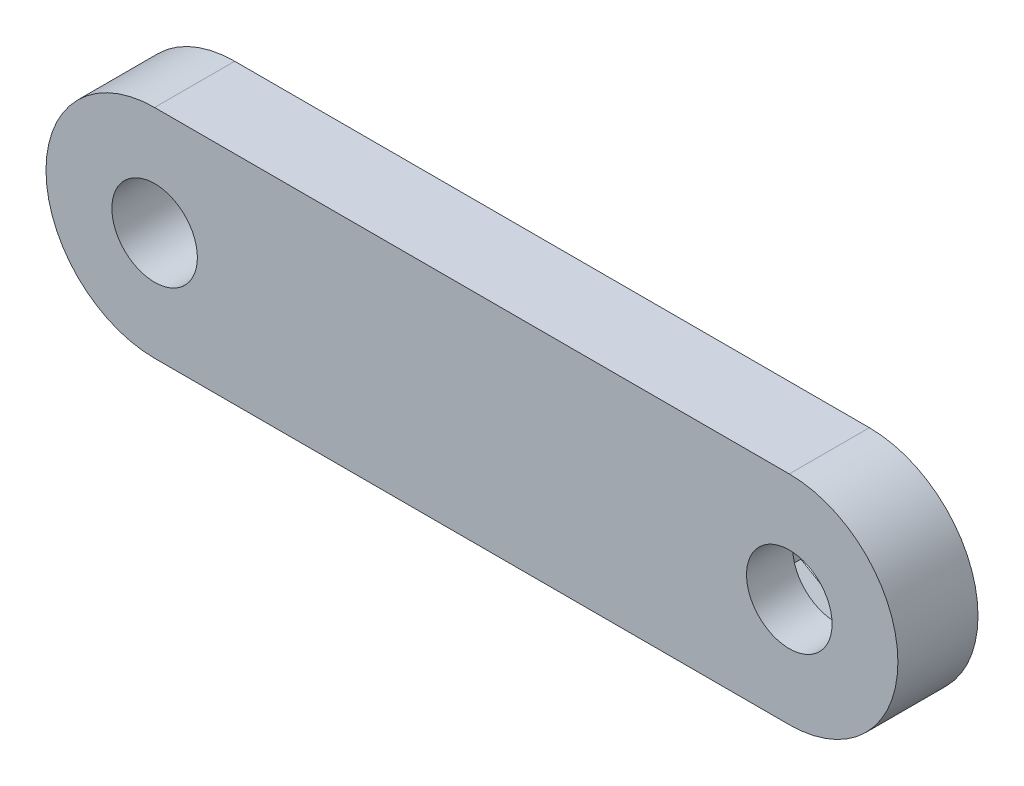
ISO-10303-21;
HEADER;
FILE_DESCRIPTION(('STEP AP214'),'2;1');
FILE_NAME('part.step','',(''),(''),'','','');
FILE_SCHEMA(('AUTOMOTIVE_DESIGN { 1 0 10303 214 1 1 1 1 }'));
ENDSEC;
DATA;
#1=APPLICATION_CONTEXT('core data for automotive mechanical design processes');
#2=APPLICATION_PROTOCOL_DEFINITION('international standard','automotive_design',2000,#1);
#3=PRODUCT_CONTEXT('',#1,'mechanical');
#4=PRODUCT('Part','Part','',(#3));
#5=PRODUCT_RELATED_PRODUCT_CATEGORY('part','',(#4));
#6=PRODUCT_DEFINITION_FORMATION('','',#4);
#7=PRODUCT_DEFINITION_CONTEXT('part definition',#1,'design');
#8=PRODUCT_DEFINITION('design','',#6,#7);
#9=PRODUCT_DEFINITION_SHAPE('','',#8);
#10=(LENGTH_UNIT() NAMED_UNIT(*) SI_UNIT(.MILLI.,.METRE.));
#11=(NAMED_UNIT(*) PLANE_ANGLE_UNIT() SI_UNIT($,.RADIAN.));
#12=(NAMED_UNIT(*) SI_UNIT($,.STERADIAN.) SOLID_ANGLE_UNIT());
#13=UNCERTAINTY_MEASURE_WITH_UNIT(LENGTH_MEASURE(1.E-05),#10,'distance_accuracy_value','');
#14=(GEOMETRIC_REPRESENTATION_CONTEXT(3) GLOBAL_UNCERTAINTY_ASSIGNED_CONTEXT((#13)) GLOBAL_UNIT_ASSIGNED_CONTEXT((#10,
#11,#12)) REPRESENTATION_CONTEXT('',''));
#15=CARTESIAN_POINT('',(0.,0.,0.));
#16=DIRECTION('',(0.,0.,1.));
#17=DIRECTION('',(1.,0.,0.));
#18=AXIS2_PLACEMENT_3D('',#15,#16,#17);
#19=CARTESIAN_POINT('',(23.375,0.,0.));
#20=DIRECTION('',(0.,0.,1.));
#21=DIRECTION('',(1.,0.,0.));
#22=AXIS2_PLACEMENT_3D('',#19,#20,#21);
#23=PLANE('',#22);
#24=CARTESIAN_POINT('',(-23.375,0.,0.));
#25=DIRECTION('',(0.,0.,1.));
#26=DIRECTION('',(1.,0.,0.));
#27=AXIS2_PLACEMENT_3D('',#24,#25,#26);
#28=CIRCLE('',#27,3.15);
#29=CARTESIAN_POINT('',(-20.225,0.,0.));
#30=VERTEX_POINT('',#29);
#31=EDGE_CURVE('E155',#30,#30,#28,.T.);
#32=ORIENTED_EDGE('',*,*,#31,.T.);
#33=EDGE_LOOP('',(#32));
#34=FACE_BOUND('',#33,.T.);
#35=CARTESIAN_POINT('',(23.375,0.,0.));
#36=DIRECTION('',(0.,0.,1.));
#37=DIRECTION('',(1.,0.,0.));
#38=AXIS2_PLACEMENT_3D('',#35,#36,#37);
#39=CIRCLE('',#38,8.);
#40=CARTESIAN_POINT('',(23.375,-7.99999999999999,0.));
#41=VERTEX_POINT('',#40);
#42=CARTESIAN_POINT('',(23.375,8.00000000000001,0.));
#43=VERTEX_POINT('',#42);
#44=EDGE_CURVE('E170',#41,#43,#39,.T.);
#45=ORIENTED_EDGE('',*,*,#44,.F.);
#46=DIRECTION('',(1.,0.,0.));
#47=VECTOR('',#46,1.);
#48=CARTESIAN_POINT('',(23.375,-7.99999999999999,0.));
#49=LINE('',#48,#47);
#50=CARTESIAN_POINT('',(-23.375,-8.,0.));
#51=VERTEX_POINT('',#50);
#52=EDGE_CURVE('E89',#51,#41,#49,.T.);
#53=ORIENTED_EDGE('',*,*,#52,.F.);
#54=CARTESIAN_POINT('',(-23.375,0.,0.));
#55=DIRECTION('',(0.,0.,1.));
#56=DIRECTION('',(1.,0.,0.));
#57=AXIS2_PLACEMENT_3D('',#54,#55,#56);
#58=CIRCLE('',#57,8.);
#59=CARTESIAN_POINT('',(-23.375,7.99999999999999,0.));
#60=VERTEX_POINT('',#59);
#61=EDGE_CURVE('E186',#60,#51,#58,.T.);
#62=ORIENTED_EDGE('',*,*,#61,.F.);
#63=DIRECTION('',(-1.,0.,0.));
#64=VECTOR('',#63,1.);
#65=CARTESIAN_POINT('',(23.375,8.00000000000001,0.));
#66=LINE('',#65,#64);
#67=EDGE_CURVE('E183',#43,#60,#66,.T.);
#68=ORIENTED_EDGE('',*,*,#67,.F.);
#69=EDGE_LOOP('',(#45,#53,#62,#68));
#70=FACE_BOUND('',#69,.T.);
#71=DIRECTION('',(-0.866025403784439,0.5,0.));
#72=VECTOR('',#71,1.);
#73=CARTESIAN_POINT('',(28.425,2.91561885940763,0.));
#74=LINE('',#73,#72);
#75=CARTESIAN_POINT('',(28.425,2.91561885940763,0.));
#76=VERTEX_POINT('',#75);
#77=CARTESIAN_POINT('',(23.375,5.83123771881524,0.));
#78=VERTEX_POINT('',#77);
#79=EDGE_CURVE('E56',#76,#78,#74,.T.);
#80=ORIENTED_EDGE('',*,*,#79,.T.);
#81=DIRECTION('',(-0.866025403784439,-0.5,0.));
#82=VECTOR('',#81,1.);
#83=CARTESIAN_POINT('',(23.375,5.83123771881524,0.));
#84=LINE('',#83,#82);
#85=CARTESIAN_POINT('',(18.325,2.91561885940763,0.));
#86=VERTEX_POINT('',#85);
#87=EDGE_CURVE('E151',#78,#86,#84,.T.);
#88=ORIENTED_EDGE('',*,*,#87,.T.);
#89=DIRECTION('',(0.,-1.,0.));
#90=VECTOR('',#89,1.);
#91=CARTESIAN_POINT('',(18.325,2.91561885940763,0.));
#92=LINE('',#91,#90);
#93=CARTESIAN_POINT('',(18.325,-2.9156188594076,0.));
#94=VERTEX_POINT('',#93);
#95=EDGE_CURVE('E367',#86,#94,#92,.T.);
#96=ORIENTED_EDGE('',*,*,#95,.T.);
#97=DIRECTION('',(0.866025403784439,-0.5,0.));
#98=VECTOR('',#97,1.);
#99=CARTESIAN_POINT('',(18.325,-2.9156188594076,0.));
#100=LINE('',#99,#98);
#101=CARTESIAN_POINT('',(23.375,-5.83123771881521,0.));
#102=VERTEX_POINT('',#101);
#103=EDGE_CURVE('E364',#94,#102,#100,.T.);
#104=ORIENTED_EDGE('',*,*,#103,.T.);
#105=DIRECTION('',(0.866025403784439,0.5,0.));
#106=VECTOR('',#105,1.);
#107=CARTESIAN_POINT('',(23.375,-5.83123771881521,0.));
#108=LINE('',#107,#106);
#109=CARTESIAN_POINT('',(28.425,-2.91561885940761,0.));
#110=VERTEX_POINT('',#109);
#111=EDGE_CURVE('E358',#102,#110,#108,.T.);
#112=ORIENTED_EDGE('',*,*,#111,.T.);
#113=DIRECTION('',(0.,1.,0.));
#114=VECTOR('',#113,1.);
#115=CARTESIAN_POINT('',(28.425,-2.91561885940761,0.));
#116=LINE('',#115,#114);
#117=EDGE_CURVE('E147',#110,#76,#116,.T.);
#118=ORIENTED_EDGE('',*,*,#117,.T.);
#119=EDGE_LOOP('',(#80,#88,#96,#104,#112,#118));
#120=FACE_BOUND('',#119,.T.);
#121=ADVANCED_FACE('F40',(#34,#70,#120),#23,.F.);
#122=CARTESIAN_POINT('',(23.375,0.,5.9));
#123=DIRECTION('',(0.,0.,1.));
#124=DIRECTION('',(1.,0.,0.));
#125=AXIS2_PLACEMENT_3D('',#122,#123,#124);
#126=PLANE('',#125);
#127=CARTESIAN_POINT('',(23.375,0.,5.9));
#128=DIRECTION('',(0.,0.,1.));
#129=DIRECTION('',(1.,0.,0.));
#130=AXIS2_PLACEMENT_3D('',#127,#128,#129);
#131=CIRCLE('',#130,3.15);
#132=CARTESIAN_POINT('',(26.525,0.,5.9));
#133=VERTEX_POINT('',#132);
#134=EDGE_CURVE('E164',#133,#133,#131,.T.);
#135=ORIENTED_EDGE('',*,*,#134,.F.);
#136=EDGE_LOOP('',(#135));
#137=FACE_BOUND('',#136,.T.);
#138=CARTESIAN_POINT('',(23.375,0.,5.9));
#139=DIRECTION('',(0.,0.,1.));
#140=DIRECTION('',(1.,0.,0.));
#141=AXIS2_PLACEMENT_3D('',#138,#139,#140);
#142=CIRCLE('',#141,8.);
#143=CARTESIAN_POINT('',(23.375,-7.99999999999999,5.9));
#144=VERTEX_POINT('',#143);
#145=CARTESIAN_POINT('',(23.375,8.00000000000001,5.9));
#146=VERTEX_POINT('',#145);
#147=EDGE_CURVE('E171',#144,#146,#142,.T.);
#148=ORIENTED_EDGE('',*,*,#147,.T.);
#149=DIRECTION('',(-1.,0.,0.));
#150=VECTOR('',#149,1.);
#151=CARTESIAN_POINT('',(23.375,8.00000000000001,5.9));
#152=LINE('',#151,#150);
#153=CARTESIAN_POINT('',(-23.375,7.99999999999999,5.9));
#154=VERTEX_POINT('',#153);
#155=EDGE_CURVE('E96',#146,#154,#152,.T.);
#156=ORIENTED_EDGE('',*,*,#155,.T.);
#157=CARTESIAN_POINT('',(-23.375,0.,5.9));
#158=DIRECTION('',(0.,0.,1.));
#159=DIRECTION('',(1.,0.,0.));
#160=AXIS2_PLACEMENT_3D('',#157,#158,#159);
#161=CIRCLE('',#160,8.);
#162=CARTESIAN_POINT('',(-23.375,-8.,5.9));
#163=VERTEX_POINT('',#162);
#164=EDGE_CURVE('E175',#154,#163,#161,.T.);
#165=ORIENTED_EDGE('',*,*,#164,.T.);
#166=DIRECTION('',(1.,0.,0.));
#167=VECTOR('',#166,1.);
#168=CARTESIAN_POINT('',(23.375,-7.99999999999999,5.9));
#169=LINE('',#168,#167);
#170=EDGE_CURVE('E65',#163,#144,#169,.T.);
#171=ORIENTED_EDGE('',*,*,#170,.T.);
#172=EDGE_LOOP('',(#148,#156,#165,#171));
#173=FACE_BOUND('',#172,.T.);
#174=CARTESIAN_POINT('',(-23.375,0.,5.9));
#175=DIRECTION('',(0.,0.,1.));
#176=DIRECTION('',(1.,0.,0.));
#177=AXIS2_PLACEMENT_3D('',#174,#175,#176);
#178=CIRCLE('',#177,3.15);
#179=CARTESIAN_POINT('',(-20.225,0.,5.9));
#180=VERTEX_POINT('',#179);
#181=EDGE_CURVE('E160',#180,#180,#178,.T.);
#182=ORIENTED_EDGE('',*,*,#181,.F.);
#183=EDGE_LOOP('',(#182));
#184=FACE_BOUND('',#183,.T.);
#185=ADVANCED_FACE('F222',(#137,#173,#184),#126,.T.);
#186=CARTESIAN_POINT('',(23.375,0.,5.9));
#187=DIRECTION('',(0.,0.,-1.));
#188=DIRECTION('',(-1.,0.,0.));
#189=AXIS2_PLACEMENT_3D('',#186,#187,#188);
#190=CYLINDRICAL_SURFACE('',#189,8.);
#191=ORIENTED_EDGE('',*,*,#44,.T.);
#192=DIRECTION('',(0.,0.,-1.));
#193=VECTOR('',#192,1.);
#194=CARTESIAN_POINT('',(23.375,8.00000000000001,5.9));
#195=LINE('',#194,#193);
#196=EDGE_CURVE('E11',#146,#43,#195,.T.);
#197=ORIENTED_EDGE('',*,*,#196,.F.);
#198=ORIENTED_EDGE('',*,*,#147,.F.);
#199=DIRECTION('',(0.,0.,-1.));
#200=VECTOR('',#199,1.);
#201=CARTESIAN_POINT('',(23.375,-7.99999999999999,5.9));
#202=LINE('',#201,#200);
#203=EDGE_CURVE('E180',#144,#41,#202,.T.);
#204=ORIENTED_EDGE('',*,*,#203,.T.);
#205=EDGE_LOOP('',(#191,#197,#198,#204));
#206=FACE_BOUND('',#205,.T.);
#207=ADVANCED_FACE('F42',(#206),#190,.T.);
#208=CARTESIAN_POINT('',(23.375,8.00000000000001,5.9));
#209=DIRECTION('',(0.,-1.,0.));
#210=DIRECTION('',(1.,0.,0.));
#211=AXIS2_PLACEMENT_3D('',#208,#209,#210);
#212=PLANE('',#211);
#213=ORIENTED_EDGE('',*,*,#67,.T.);
#214=DIRECTION('',(0.,0.,-1.));
#215=VECTOR('',#214,1.);
#216=CARTESIAN_POINT('',(-23.375,7.99999999999999,5.9));
#217=LINE('',#216,#215);
#218=EDGE_CURVE('E49',#154,#60,#217,.T.);
#219=ORIENTED_EDGE('',*,*,#218,.F.);
#220=ORIENTED_EDGE('',*,*,#155,.F.);
#221=ORIENTED_EDGE('',*,*,#196,.T.);
#222=EDGE_LOOP('',(#213,#219,#220,#221));
#223=FACE_BOUND('',#222,.T.);
#224=ADVANCED_FACE('F219',(#223),#212,.F.);
#225=CARTESIAN_POINT('',(-23.375,0.,5.9));
#226=DIRECTION('',(0.,0.,-1.));
#227=DIRECTION('',(-1.,0.,0.));
#228=AXIS2_PLACEMENT_3D('',#225,#226,#227);
#229=CYLINDRICAL_SURFACE('',#228,8.);
#230=ORIENTED_EDGE('',*,*,#61,.T.);
#231=DIRECTION('',(0.,0.,-1.));
#232=VECTOR('',#231,1.);
#233=CARTESIAN_POINT('',(-23.375,-8.,5.9));
#234=LINE('',#233,#232);
#235=EDGE_CURVE('E192',#163,#51,#234,.T.);
#236=ORIENTED_EDGE('',*,*,#235,.F.);
#237=ORIENTED_EDGE('',*,*,#164,.F.);
#238=ORIENTED_EDGE('',*,*,#218,.T.);
#239=EDGE_LOOP('',(#230,#236,#237,#238));
#240=FACE_BOUND('',#239,.T.);
#241=ADVANCED_FACE('F200',(#240),#229,.T.);
#242=CARTESIAN_POINT('',(23.375,-7.99999999999999,5.9));
#243=DIRECTION('',(0.,1.,0.));
#244=DIRECTION('',(-1.,0.,0.));
#245=AXIS2_PLACEMENT_3D('',#242,#243,#244);
#246=PLANE('',#245);
#247=ORIENTED_EDGE('',*,*,#52,.T.);
#248=ORIENTED_EDGE('',*,*,#203,.F.);
#249=ORIENTED_EDGE('',*,*,#170,.F.);
#250=ORIENTED_EDGE('',*,*,#235,.T.);
#251=EDGE_LOOP('',(#247,#248,#249,#250));
#252=FACE_BOUND('',#251,.T.);
#253=ADVANCED_FACE('F208',(#252),#246,.F.);
#254=CARTESIAN_POINT('',(23.375,0.,5.9));
#255=DIRECTION('',(0.,0.,-1.));
#256=DIRECTION('',(-1.,0.,0.));
#257=AXIS2_PLACEMENT_3D('',#254,#255,#256);
#258=CYLINDRICAL_SURFACE('',#257,3.15);
#259=CARTESIAN_POINT('',(23.375,0.,2.5));
#260=DIRECTION('',(0.,0.,1.));
#261=DIRECTION('',(1.,0.,0.));
#262=AXIS2_PLACEMENT_3D('',#259,#260,#261);
#263=CIRCLE('',#262,3.15);
#264=CARTESIAN_POINT('',(26.525,0.,2.5));
#265=VERTEX_POINT('',#264);
#266=EDGE_CURVE('E44',#265,#265,#263,.T.);
#267=ORIENTED_EDGE('',*,*,#266,.F.);
#268=EDGE_LOOP('',(#267));
#269=FACE_BOUND('',#268,.T.);
#270=ORIENTED_EDGE('',*,*,#134,.T.);
#271=EDGE_LOOP('',(#270));
#272=FACE_BOUND('',#271,.T.);
#273=ADVANCED_FACE('F210',(#269,#272),#258,.F.);
#274=CARTESIAN_POINT('',(-23.375,0.,5.9));
#275=DIRECTION('',(0.,0.,-1.));
#276=DIRECTION('',(-1.,0.,0.));
#277=AXIS2_PLACEMENT_3D('',#274,#275,#276);
#278=CYLINDRICAL_SURFACE('',#277,3.15);
#279=ORIENTED_EDGE('',*,*,#181,.T.);
#280=EDGE_LOOP('',(#279));
#281=FACE_BOUND('',#280,.T.);
#282=ORIENTED_EDGE('',*,*,#31,.F.);
#283=EDGE_LOOP('',(#282));
#284=FACE_BOUND('',#283,.T.);
#285=ADVANCED_FACE('F215',(#281,#284),#278,.F.);
#286=CARTESIAN_POINT('',(28.425,2.91561885940763,2.5));
#287=DIRECTION('',(-0.5,-0.866025403784439,0.));
#288=DIRECTION('',(0.866025403784439,-0.5,0.));
#289=AXIS2_PLACEMENT_3D('',#286,#287,#288);
#290=PLANE('',#289);
#291=ORIENTED_EDGE('',*,*,#79,.F.);
#292=DIRECTION('',(0.,0.,-1.));
#293=VECTOR('',#292,1.);
#294=CARTESIAN_POINT('',(28.425,2.91561885940763,2.5));
#295=LINE('',#294,#293);
#296=CARTESIAN_POINT('',(28.425,2.91561885940763,2.5));
#297=VERTEX_POINT('',#296);
#298=EDGE_CURVE('E146',#297,#76,#295,.T.);
#299=ORIENTED_EDGE('',*,*,#298,.F.);
#300=DIRECTION('',(-0.866025403784439,0.5,0.));
#301=VECTOR('',#300,1.);
#302=CARTESIAN_POINT('',(28.425,2.91561885940763,2.5));
#303=LINE('',#302,#301);
#304=CARTESIAN_POINT('',(23.375,5.83123771881524,2.5));
#305=VERTEX_POINT('',#304);
#306=EDGE_CURVE('E137',#297,#305,#303,.T.);
#307=ORIENTED_EDGE('',*,*,#306,.T.);
#308=DIRECTION('',(0.,0.,-1.));
#309=VECTOR('',#308,1.);
#310=CARTESIAN_POINT('',(23.375,5.83123771881524,2.5));
#311=LINE('',#310,#309);
#312=EDGE_CURVE('E145',#305,#78,#311,.T.);
#313=ORIENTED_EDGE('',*,*,#312,.T.);
#314=EDGE_LOOP('',(#291,#299,#307,#313));
#315=FACE_BOUND('',#314,.T.);
#316=ADVANCED_FACE('F144',(#315),#290,.T.);
#317=CARTESIAN_POINT('',(23.375,5.83123771881524,2.5));
#318=DIRECTION('',(0.5,-0.866025403784439,0.));
#319=DIRECTION('',(0.866025403784439,0.5,0.));
#320=AXIS2_PLACEMENT_3D('',#317,#318,#319);
#321=PLANE('',#320);
#322=ORIENTED_EDGE('',*,*,#87,.F.);
#323=ORIENTED_EDGE('',*,*,#312,.F.);
#324=DIRECTION('',(-0.866025403784439,-0.5,0.));
#325=VECTOR('',#324,1.);
#326=CARTESIAN_POINT('',(23.375,5.83123771881524,2.5));
#327=LINE('',#326,#325);
#328=CARTESIAN_POINT('',(18.325,2.91561885940763,2.5));
#329=VERTEX_POINT('',#328);
#330=EDGE_CURVE('E133',#305,#329,#327,.T.);
#331=ORIENTED_EDGE('',*,*,#330,.T.);
#332=DIRECTION('',(0.,0.,-1.));
#333=VECTOR('',#332,1.);
#334=CARTESIAN_POINT('',(18.325,2.91561885940763,2.5));
#335=LINE('',#334,#333);
#336=EDGE_CURVE('E152',#329,#86,#335,.T.);
#337=ORIENTED_EDGE('',*,*,#336,.T.);
#338=EDGE_LOOP('',(#322,#323,#331,#337));
#339=FACE_BOUND('',#338,.T.);
#340=ADVANCED_FACE('F149',(#339),#321,.T.);
#341=CARTESIAN_POINT('',(18.325,2.91561885940763,2.5));
#342=DIRECTION('',(1.,0.,0.));
#343=DIRECTION('',(0.,0.,-1.));
#344=AXIS2_PLACEMENT_3D('',#341,#342,#343);
#345=PLANE('',#344);
#346=ORIENTED_EDGE('',*,*,#95,.F.);
#347=ORIENTED_EDGE('',*,*,#336,.F.);
#348=DIRECTION('',(0.,-1.,0.));
#349=VECTOR('',#348,1.);
#350=CARTESIAN_POINT('',(18.325,2.91561885940763,2.5));
#351=LINE('',#350,#349);
#352=CARTESIAN_POINT('',(18.325,-2.9156188594076,2.5));
#353=VERTEX_POINT('',#352);
#354=EDGE_CURVE('E139',#329,#353,#351,.T.);
#355=ORIENTED_EDGE('',*,*,#354,.T.);
#356=DIRECTION('',(0.,0.,-1.));
#357=VECTOR('',#356,1.);
#358=CARTESIAN_POINT('',(18.325,-2.9156188594076,2.5));
#359=LINE('',#358,#357);
#360=EDGE_CURVE('E156',#353,#94,#359,.T.);
#361=ORIENTED_EDGE('',*,*,#360,.T.);
#362=EDGE_LOOP('',(#346,#347,#355,#361));
#363=FACE_BOUND('',#362,.T.);
#364=ADVANCED_FACE('F236',(#363),#345,.T.);
#365=CARTESIAN_POINT('',(18.325,-2.9156188594076,2.5));
#366=DIRECTION('',(0.5,0.866025403784439,0.));
#367=DIRECTION('',(-0.866025403784439,0.5,0.));
#368=AXIS2_PLACEMENT_3D('',#365,#366,#367);
#369=PLANE('',#368);
#370=ORIENTED_EDGE('',*,*,#103,.F.);
#371=ORIENTED_EDGE('',*,*,#360,.F.);
#372=DIRECTION('',(0.866025403784439,-0.5,0.));
#373=VECTOR('',#372,1.);
#374=CARTESIAN_POINT('',(18.325,-2.9156188594076,2.5));
#375=LINE('',#374,#373);
#376=CARTESIAN_POINT('',(23.375,-5.83123771881521,2.5));
#377=VERTEX_POINT('',#376);
#378=EDGE_CURVE('E383',#353,#377,#375,.T.);
#379=ORIENTED_EDGE('',*,*,#378,.T.);
#380=DIRECTION('',(0.,0.,-1.));
#381=VECTOR('',#380,1.);
#382=CARTESIAN_POINT('',(23.375,-5.83123771881521,2.5));
#383=LINE('',#382,#381);
#384=EDGE_CURVE('E374',#377,#102,#383,.T.);
#385=ORIENTED_EDGE('',*,*,#384,.T.);
#386=EDGE_LOOP('',(#370,#371,#379,#385));
#387=FACE_BOUND('',#386,.T.);
#388=ADVANCED_FACE('F239',(#387),#369,.T.);
#389=CARTESIAN_POINT('',(23.375,-5.83123771881521,2.5));
#390=DIRECTION('',(-0.5,0.866025403784439,0.));
#391=DIRECTION('',(-0.866025403784439,-0.5,0.));
#392=AXIS2_PLACEMENT_3D('',#389,#390,#391);
#393=PLANE('',#392);
#394=ORIENTED_EDGE('',*,*,#111,.F.);
#395=ORIENTED_EDGE('',*,*,#384,.F.);
#396=DIRECTION('',(0.866025403784439,0.5,0.));
#397=VECTOR('',#396,1.);
#398=CARTESIAN_POINT('',(23.375,-5.83123771881521,2.5));
#399=LINE('',#398,#397);
#400=CARTESIAN_POINT('',(28.425,-2.91561885940761,2.5));
#401=VERTEX_POINT('',#400);
#402=EDGE_CURVE('E381',#377,#401,#399,.T.);
#403=ORIENTED_EDGE('',*,*,#402,.T.);
#404=DIRECTION('',(0.,0.,-1.));
#405=VECTOR('',#404,1.);
#406=CARTESIAN_POINT('',(28.425,-2.91561885940761,2.5));
#407=LINE('',#406,#405);
#408=EDGE_CURVE('E357',#401,#110,#407,.T.);
#409=ORIENTED_EDGE('',*,*,#408,.T.);
#410=EDGE_LOOP('',(#394,#395,#403,#409));
#411=FACE_BOUND('',#410,.T.);
#412=ADVANCED_FACE('F243',(#411),#393,.T.);
#413=CARTESIAN_POINT('',(28.425,-2.91561885940761,2.5));
#414=DIRECTION('',(-1.,0.,0.));
#415=DIRECTION('',(0.,0.,1.));
#416=AXIS2_PLACEMENT_3D('',#413,#414,#415);
#417=PLANE('',#416);
#418=ORIENTED_EDGE('',*,*,#117,.F.);
#419=ORIENTED_EDGE('',*,*,#408,.F.);
#420=DIRECTION('',(0.,1.,0.));
#421=VECTOR('',#420,1.);
#422=CARTESIAN_POINT('',(28.425,-2.91561885940761,2.5));
#423=LINE('',#422,#421);
#424=EDGE_CURVE('E372',#401,#297,#423,.T.);
#425=ORIENTED_EDGE('',*,*,#424,.T.);
#426=ORIENTED_EDGE('',*,*,#298,.T.);
#427=EDGE_LOOP('',(#418,#419,#425,#426));
#428=FACE_BOUND('',#427,.T.);
#429=ADVANCED_FACE('F247',(#428),#417,.T.);
#430=CARTESIAN_POINT('',(0.,0.,2.5));
#431=DIRECTION('',(0.,0.,1.));
#432=DIRECTION('',(1.,0.,0.));
#433=AXIS2_PLACEMENT_3D('',#430,#431,#432);
#434=PLANE('',#433);
#435=ORIENTED_EDGE('',*,*,#266,.T.);
#436=EDGE_LOOP('',(#435));
#437=FACE_BOUND('',#436,.T.);
#438=ORIENTED_EDGE('',*,*,#306,.F.);
#439=ORIENTED_EDGE('',*,*,#424,.F.);
#440=ORIENTED_EDGE('',*,*,#402,.F.);
#441=ORIENTED_EDGE('',*,*,#378,.F.);
#442=ORIENTED_EDGE('',*,*,#354,.F.);
#443=ORIENTED_EDGE('',*,*,#330,.F.);
#444=EDGE_LOOP('',(#438,#439,#440,#441,#442,#443));
#445=FACE_BOUND('',#444,.T.);
#446=ADVANCED_FACE('F135',(#437,#445),#434,.F.);
#447=CLOSED_SHELL('',(#121,#185,#207,#224,#241,#253,#273,#285,#316,#340,#364,#388,#412,#429,#446));
#448=MANIFOLD_SOLID_BREP('B2',#447);
#449=ADVANCED_BREP_SHAPE_REPRESENTATION('',(#18,#448),#14);
#450=SHAPE_DEFINITION_REPRESENTATION(#9,#449);
ENDSEC;
END-ISO-10303-21;
